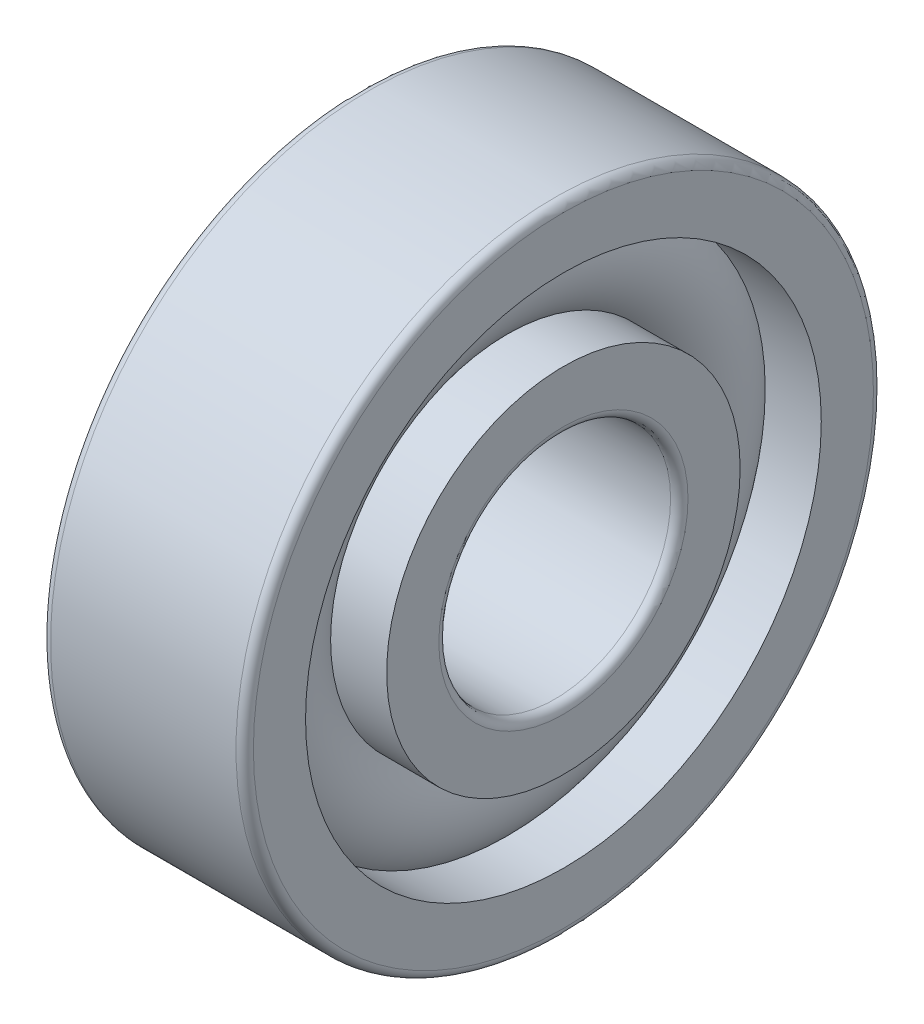
ISO-10303-21;
HEADER;
FILE_DESCRIPTION(('STEP AP214'),'2;1');
FILE_NAME('part.step','',(''),(''),'','','');
FILE_SCHEMA(('AUTOMOTIVE_DESIGN { 1 0 10303 214 1 1 1 1 }'));
ENDSEC;
DATA;
#1=APPLICATION_CONTEXT('core data for automotive mechanical design processes');
#2=APPLICATION_PROTOCOL_DEFINITION('international standard','automotive_design',2000,#1);
#3=PRODUCT_CONTEXT('',#1,'mechanical');
#4=PRODUCT('Part','Part','',(#3));
#5=PRODUCT_RELATED_PRODUCT_CATEGORY('part','',(#4));
#6=PRODUCT_DEFINITION_FORMATION('','',#4);
#7=PRODUCT_DEFINITION_CONTEXT('part definition',#1,'design');
#8=PRODUCT_DEFINITION('design','',#6,#7);
#9=PRODUCT_DEFINITION_SHAPE('','',#8);
#10=(LENGTH_UNIT() NAMED_UNIT(*) SI_UNIT(.MILLI.,.METRE.));
#11=(NAMED_UNIT(*) PLANE_ANGLE_UNIT() SI_UNIT($,.RADIAN.));
#12=(NAMED_UNIT(*) SI_UNIT($,.STERADIAN.) SOLID_ANGLE_UNIT());
#13=UNCERTAINTY_MEASURE_WITH_UNIT(LENGTH_MEASURE(1.E-05),#10,'distance_accuracy_value','');
#14=(GEOMETRIC_REPRESENTATION_CONTEXT(3) GLOBAL_UNCERTAINTY_ASSIGNED_CONTEXT((#13)) GLOBAL_UNIT_ASSIGNED_CONTEXT((#10,
#11,#12)) REPRESENTATION_CONTEXT('',''));
#15=CARTESIAN_POINT('',(0.,0.,0.));
#16=DIRECTION('',(0.,0.,1.));
#17=DIRECTION('',(1.,0.,0.));
#18=AXIS2_PLACEMENT_3D('',#15,#16,#17);
#19=CARTESIAN_POINT('',(0.,0.,0.));
#20=DIRECTION('',(-1.,0.,0.));
#21=DIRECTION('',(0.,0.,1.));
#22=AXIS2_PLACEMENT_3D('',#19,#20,#21);
#23=TOROIDAL_SURFACE('',#22,7.5,2.1);
#24=CARTESIAN_POINT('',(1.56524758424985,0.,0.));
#25=DIRECTION('',(-1.,0.,0.));
#26=DIRECTION('',(0.,0.,1.));
#27=AXIS2_PLACEMENT_3D('',#24,#25,#26);
#28=CIRCLE('',#27,8.90000000000001);
#29=CARTESIAN_POINT('',(1.56524758424985,0.,8.90000000000001));
#30=VERTEX_POINT('',#29);
#31=EDGE_CURVE('E34',#30,#30,#28,.F.);
#32=ORIENTED_EDGE('',*,*,#31,.T.);
#33=EDGE_LOOP('',(#32));
#34=FACE_BOUND('',#33,.T.);
#35=CARTESIAN_POINT('',(1.56524758424985,0.,0.));
#36=DIRECTION('',(-1.,0.,0.));
#37=DIRECTION('',(0.,0.,1.));
#38=AXIS2_PLACEMENT_3D('',#35,#36,#37);
#39=CIRCLE('',#38,6.1);
#40=CARTESIAN_POINT('',(1.56524758424985,0.,6.1));
#41=VERTEX_POINT('',#40);
#42=EDGE_CURVE('E10',#41,#41,#39,.T.);
#43=ORIENTED_EDGE('',*,*,#42,.T.);
#44=EDGE_LOOP('',(#43));
#45=FACE_BOUND('',#44,.T.);
#46=ADVANCED_FACE('F30',(#34,#45),#23,.T.);
#47=CARTESIAN_POINT('',(-20.6375,0.,0.));
#48=DIRECTION('',(1.,0.,0.));
#49=DIRECTION('',(0.,0.,-1.));
#50=AXIS2_PLACEMENT_3D('',#47,#48,#49);
#51=CYLINDRICAL_SURFACE('',#50,6.1);
#52=CARTESIAN_POINT('',(3.5,0.,0.));
#53=DIRECTION('',(1.,0.,0.));
#54=DIRECTION('',(0.,0.,-1.));
#55=AXIS2_PLACEMENT_3D('',#52,#53,#54);
#56=CIRCLE('',#55,6.1);
#57=CARTESIAN_POINT('',(3.5,0.,-6.1));
#58=VERTEX_POINT('',#57);
#59=EDGE_CURVE('E43',#58,#58,#56,.T.);
#60=ORIENTED_EDGE('',*,*,#59,.F.);
#61=EDGE_LOOP('',(#60));
#62=FACE_BOUND('',#61,.T.);
#63=ORIENTED_EDGE('',*,*,#42,.F.);
#64=EDGE_LOOP('',(#63));
#65=FACE_BOUND('',#64,.T.);
#66=ADVANCED_FACE('F82',(#62,#65),#51,.T.);
#67=CARTESIAN_POINT('',(-20.6375,0.,0.));
#68=DIRECTION('',(1.,0.,0.));
#69=DIRECTION('',(0.,0.,-1.));
#70=AXIS2_PLACEMENT_3D('',#67,#68,#69);
#71=CYLINDRICAL_SURFACE('',#70,6.1);
#72=CARTESIAN_POINT('',(-3.5,0.,0.));
#73=DIRECTION('',(1.,0.,0.));
#74=DIRECTION('',(0.,0.,-1.));
#75=AXIS2_PLACEMENT_3D('',#72,#73,#74);
#76=CIRCLE('',#75,6.1);
#77=CARTESIAN_POINT('',(-3.5,0.,-6.1));
#78=VERTEX_POINT('',#77);
#79=EDGE_CURVE('E52',#78,#78,#76,.T.);
#80=ORIENTED_EDGE('',*,*,#79,.T.);
#81=EDGE_LOOP('',(#80));
#82=FACE_BOUND('',#81,.T.);
#83=CARTESIAN_POINT('',(-1.56524758424985,0.,0.));
#84=DIRECTION('',(1.,0.,0.));
#85=DIRECTION('',(0.,0.,-1.));
#86=AXIS2_PLACEMENT_3D('',#83,#84,#85);
#87=CIRCLE('',#86,6.1);
#88=CARTESIAN_POINT('',(-1.56524758424985,0.,-6.1));
#89=VERTEX_POINT('',#88);
#90=EDGE_CURVE('E38',#89,#89,#87,.T.);
#91=ORIENTED_EDGE('',*,*,#90,.F.);
#92=EDGE_LOOP('',(#91));
#93=FACE_BOUND('',#92,.T.);
#94=ADVANCED_FACE('F85',(#82,#93),#71,.T.);
#95=CARTESIAN_POINT('',(3.5,4.3,0.));
#96=DIRECTION('',(1.,0.,0.));
#97=DIRECTION('',(0.,0.,-1.));
#98=AXIS2_PLACEMENT_3D('',#95,#96,#97);
#99=PLANE('',#98);
#100=ORIENTED_EDGE('',*,*,#59,.T.);
#101=EDGE_LOOP('',(#100));
#102=FACE_BOUND('',#101,.T.);
#103=CARTESIAN_POINT('',(3.5,0.,0.));
#104=DIRECTION('',(1.,0.,0.));
#105=DIRECTION('',(0.,0.,-1.));
#106=AXIS2_PLACEMENT_3D('',#103,#104,#105);
#107=CIRCLE('',#106,4.3);
#108=CARTESIAN_POINT('',(3.5,0.,-4.3));
#109=VERTEX_POINT('',#108);
#110=EDGE_CURVE('E74',#109,#109,#107,.T.);
#111=ORIENTED_EDGE('',*,*,#110,.F.);
#112=EDGE_LOOP('',(#111));
#113=FACE_BOUND('',#112,.T.);
#114=ADVANCED_FACE('F79',(#102,#113),#99,.T.);
#115=CARTESIAN_POINT('',(3.2,0.,0.));
#116=DIRECTION('',(1.,0.,0.));
#117=DIRECTION('',(0.,0.,-1.));
#118=AXIS2_PLACEMENT_3D('',#115,#116,#117);
#119=TOROIDAL_SURFACE('',#118,4.3,0.3);
#120=ORIENTED_EDGE('',*,*,#110,.T.);
#121=EDGE_LOOP('',(#120));
#122=FACE_BOUND('',#121,.T.);
#123=CARTESIAN_POINT('',(3.2,0.,0.));
#124=DIRECTION('',(1.,0.,0.));
#125=DIRECTION('',(0.,0.,-1.));
#126=AXIS2_PLACEMENT_3D('',#123,#124,#125);
#127=CIRCLE('',#126,4.);
#128=CARTESIAN_POINT('',(3.2,0.,-4.));
#129=VERTEX_POINT('',#128);
#130=EDGE_CURVE('E71',#129,#129,#127,.T.);
#131=ORIENTED_EDGE('',*,*,#130,.F.);
#132=EDGE_LOOP('',(#131));
#133=FACE_BOUND('',#132,.T.);
#134=ADVANCED_FACE('F96',(#122,#133),#119,.T.);
#135=CARTESIAN_POINT('',(-20.6375,0.,0.));
#136=DIRECTION('',(1.,0.,0.));
#137=DIRECTION('',(0.,0.,-1.));
#138=AXIS2_PLACEMENT_3D('',#135,#136,#137);
#139=CYLINDRICAL_SURFACE('',#138,4.);
#140=ORIENTED_EDGE('',*,*,#130,.T.);
#141=EDGE_LOOP('',(#140));
#142=FACE_BOUND('',#141,.T.);
#143=CARTESIAN_POINT('',(-3.2,0.,0.));
#144=DIRECTION('',(1.,0.,0.));
#145=DIRECTION('',(0.,0.,-1.));
#146=AXIS2_PLACEMENT_3D('',#143,#144,#145);
#147=CIRCLE('',#146,4.);
#148=CARTESIAN_POINT('',(-3.2,0.,-4.));
#149=VERTEX_POINT('',#148);
#150=EDGE_CURVE('E68',#149,#149,#147,.T.);
#151=ORIENTED_EDGE('',*,*,#150,.F.);
#152=EDGE_LOOP('',(#151));
#153=FACE_BOUND('',#152,.T.);
#154=ADVANCED_FACE('F99',(#142,#153),#139,.F.);
#155=CARTESIAN_POINT('',(-3.2,0.,0.));
#156=DIRECTION('',(1.,0.,0.));
#157=DIRECTION('',(0.,0.,-1.));
#158=AXIS2_PLACEMENT_3D('',#155,#156,#157);
#159=TOROIDAL_SURFACE('',#158,4.3,0.3);
#160=ORIENTED_EDGE('',*,*,#150,.T.);
#161=EDGE_LOOP('',(#160));
#162=FACE_BOUND('',#161,.T.);
#163=CARTESIAN_POINT('',(-3.5,0.,0.));
#164=DIRECTION('',(1.,0.,0.));
#165=DIRECTION('',(0.,0.,-1.));
#166=AXIS2_PLACEMENT_3D('',#163,#164,#165);
#167=CIRCLE('',#166,4.3);
#168=CARTESIAN_POINT('',(-3.5,0.,-4.3));
#169=VERTEX_POINT('',#168);
#170=EDGE_CURVE('E65',#169,#169,#167,.T.);
#171=ORIENTED_EDGE('',*,*,#170,.F.);
#172=EDGE_LOOP('',(#171));
#173=FACE_BOUND('',#172,.T.);
#174=ADVANCED_FACE('F103',(#162,#173),#159,.T.);
#175=CARTESIAN_POINT('',(-3.5,6.1,0.));
#176=DIRECTION('',(-1.,0.,0.));
#177=DIRECTION('',(0.,0.,1.));
#178=AXIS2_PLACEMENT_3D('',#175,#176,#177);
#179=PLANE('',#178);
#180=ORIENTED_EDGE('',*,*,#170,.T.);
#181=EDGE_LOOP('',(#180));
#182=FACE_BOUND('',#181,.T.);
#183=ORIENTED_EDGE('',*,*,#79,.F.);
#184=EDGE_LOOP('',(#183));
#185=FACE_BOUND('',#184,.T.);
#186=ADVANCED_FACE('F107',(#182,#185),#179,.T.);
#187=CARTESIAN_POINT('',(-1.56524758424985,0.,0.));
#188=DIRECTION('',(1.,0.,0.));
#189=DIRECTION('',(0.,0.,-1.));
#190=AXIS2_PLACEMENT_3D('',#187,#188,#189);
#191=CIRCLE('',#190,8.90000000000001);
#192=CARTESIAN_POINT('',(-1.56524758424985,0.,-8.90000000000001));
#193=VERTEX_POINT('',#192);
#194=EDGE_CURVE('E46',#193,#193,#191,.F.);
#195=ORIENTED_EDGE('',*,*,#194,.T.);
#196=EDGE_LOOP('',(#195));
#197=FACE_BOUND('',#196,.T.);
#198=ORIENTED_EDGE('',*,*,#90,.T.);
#199=EDGE_LOOP('',(#198));
#200=FACE_BOUND('',#199,.T.);
#201=ADVANCED_FACE('F32',(#197,#200),#23,.T.);
#202=CARTESIAN_POINT('',(-20.6375,0.,0.));
#203=DIRECTION('',(1.,0.,0.));
#204=DIRECTION('',(0.,0.,-1.));
#205=AXIS2_PLACEMENT_3D('',#202,#203,#204);
#206=CYLINDRICAL_SURFACE('',#205,8.90000000000001);
#207=CARTESIAN_POINT('',(3.5,0.,0.));
#208=DIRECTION('',(1.,0.,0.));
#209=DIRECTION('',(0.,0.,-1.));
#210=AXIS2_PLACEMENT_3D('',#207,#208,#209);
#211=CIRCLE('',#210,8.90000000000001);
#212=CARTESIAN_POINT('',(3.5,0.,-8.90000000000001));
#213=VERTEX_POINT('',#212);
#214=EDGE_CURVE('E48',#213,#213,#211,.T.);
#215=ORIENTED_EDGE('',*,*,#214,.T.);
#216=EDGE_LOOP('',(#215));
#217=FACE_BOUND('',#216,.T.);
#218=ORIENTED_EDGE('',*,*,#31,.F.);
#219=EDGE_LOOP('',(#218));
#220=FACE_BOUND('',#219,.T.);
#221=ADVANCED_FACE('F112',(#217,#220),#206,.F.);
#222=CARTESIAN_POINT('',(-20.6375,0.,0.));
#223=DIRECTION('',(1.,0.,0.));
#224=DIRECTION('',(0.,0.,-1.));
#225=AXIS2_PLACEMENT_3D('',#222,#223,#224);
#226=CYLINDRICAL_SURFACE('',#225,8.90000000000001);
#227=CARTESIAN_POINT('',(-3.5,0.,0.));
#228=DIRECTION('',(1.,0.,0.));
#229=DIRECTION('',(0.,0.,-1.));
#230=AXIS2_PLACEMENT_3D('',#227,#228,#229);
#231=CIRCLE('',#230,8.90000000000001);
#232=CARTESIAN_POINT('',(-3.5,0.,-8.90000000000001));
#233=VERTEX_POINT('',#232);
#234=EDGE_CURVE('E143',#233,#233,#231,.T.);
#235=ORIENTED_EDGE('',*,*,#234,.F.);
#236=EDGE_LOOP('',(#235));
#237=FACE_BOUND('',#236,.T.);
#238=ORIENTED_EDGE('',*,*,#194,.F.);
#239=EDGE_LOOP('',(#238));
#240=FACE_BOUND('',#239,.T.);
#241=ADVANCED_FACE('F115',(#237,#240),#226,.F.);
#242=CARTESIAN_POINT('',(3.5,10.7,0.));
#243=DIRECTION('',(1.,0.,0.));
#244=DIRECTION('',(0.,0.,-1.));
#245=AXIS2_PLACEMENT_3D('',#242,#243,#244);
#246=PLANE('',#245);
#247=CARTESIAN_POINT('',(3.5,0.,0.));
#248=DIRECTION('',(1.,0.,0.));
#249=DIRECTION('',(0.,0.,-1.));
#250=AXIS2_PLACEMENT_3D('',#247,#248,#249);
#251=CIRCLE('',#250,10.7);
#252=CARTESIAN_POINT('',(3.5,0.,-10.7));
#253=VERTEX_POINT('',#252);
#254=EDGE_CURVE('E54',#253,#253,#251,.T.);
#255=ORIENTED_EDGE('',*,*,#254,.T.);
#256=EDGE_LOOP('',(#255));
#257=FACE_BOUND('',#256,.T.);
#258=ORIENTED_EDGE('',*,*,#214,.F.);
#259=EDGE_LOOP('',(#258));
#260=FACE_BOUND('',#259,.T.);
#261=ADVANCED_FACE('F116',(#257,#260),#246,.T.);
#262=CARTESIAN_POINT('',(3.2,0.,0.));
#263=DIRECTION('',(1.,0.,0.));
#264=DIRECTION('',(0.,0.,-1.));
#265=AXIS2_PLACEMENT_3D('',#262,#263,#264);
#266=TOROIDAL_SURFACE('',#265,10.7,0.3);
#267=CARTESIAN_POINT('',(3.2,0.,0.));
#268=DIRECTION('',(1.,0.,0.));
#269=DIRECTION('',(0.,0.,-1.));
#270=AXIS2_PLACEMENT_3D('',#267,#268,#269);
#271=CIRCLE('',#270,11.);
#272=CARTESIAN_POINT('',(3.2,0.,-11.));
#273=VERTEX_POINT('',#272);
#274=EDGE_CURVE('E59',#273,#273,#271,.T.);
#275=ORIENTED_EDGE('',*,*,#274,.T.);
#276=EDGE_LOOP('',(#275));
#277=FACE_BOUND('',#276,.T.);
#278=ORIENTED_EDGE('',*,*,#254,.F.);
#279=EDGE_LOOP('',(#278));
#280=FACE_BOUND('',#279,.T.);
#281=ADVANCED_FACE('F119',(#277,#280),#266,.T.);
#282=CARTESIAN_POINT('',(-20.6375,0.,0.));
#283=DIRECTION('',(1.,0.,0.));
#284=DIRECTION('',(0.,0.,-1.));
#285=AXIS2_PLACEMENT_3D('',#282,#283,#284);
#286=CYLINDRICAL_SURFACE('',#285,11.);
#287=CARTESIAN_POINT('',(-3.2,0.,0.));
#288=DIRECTION('',(1.,0.,0.));
#289=DIRECTION('',(0.,0.,-1.));
#290=AXIS2_PLACEMENT_3D('',#287,#288,#289);
#291=CIRCLE('',#290,11.);
#292=CARTESIAN_POINT('',(-3.2,0.,-11.));
#293=VERTEX_POINT('',#292);
#294=EDGE_CURVE('E147',#293,#293,#291,.T.);
#295=ORIENTED_EDGE('',*,*,#294,.T.);
#296=EDGE_LOOP('',(#295));
#297=FACE_BOUND('',#296,.T.);
#298=ORIENTED_EDGE('',*,*,#274,.F.);
#299=EDGE_LOOP('',(#298));
#300=FACE_BOUND('',#299,.T.);
#301=ADVANCED_FACE('F123',(#297,#300),#286,.T.);
#302=CARTESIAN_POINT('',(-3.2,0.,0.));
#303=DIRECTION('',(1.,0.,0.));
#304=DIRECTION('',(0.,0.,-1.));
#305=AXIS2_PLACEMENT_3D('',#302,#303,#304);
#306=TOROIDAL_SURFACE('',#305,10.7,0.3);
#307=CARTESIAN_POINT('',(-3.5,0.,0.));
#308=DIRECTION('',(1.,0.,0.));
#309=DIRECTION('',(0.,0.,-1.));
#310=AXIS2_PLACEMENT_3D('',#307,#308,#309);
#311=CIRCLE('',#310,10.7);
#312=CARTESIAN_POINT('',(-3.5,0.,-10.7));
#313=VERTEX_POINT('',#312);
#314=EDGE_CURVE('E144',#313,#313,#311,.T.);
#315=ORIENTED_EDGE('',*,*,#314,.T.);
#316=EDGE_LOOP('',(#315));
#317=FACE_BOUND('',#316,.T.);
#318=ORIENTED_EDGE('',*,*,#294,.F.);
#319=EDGE_LOOP('',(#318));
#320=FACE_BOUND('',#319,.T.);
#321=ADVANCED_FACE('F127',(#317,#320),#306,.T.);
#322=CARTESIAN_POINT('',(-3.5,8.90000000000001,0.));
#323=DIRECTION('',(-1.,0.,0.));
#324=DIRECTION('',(0.,0.,1.));
#325=AXIS2_PLACEMENT_3D('',#322,#323,#324);
#326=PLANE('',#325);
#327=ORIENTED_EDGE('',*,*,#234,.T.);
#328=EDGE_LOOP('',(#327));
#329=FACE_BOUND('',#328,.T.);
#330=ORIENTED_EDGE('',*,*,#314,.F.);
#331=EDGE_LOOP('',(#330));
#332=FACE_BOUND('',#331,.T.);
#333=ADVANCED_FACE('F131',(#329,#332),#326,.T.);
#334=CLOSED_SHELL('',(#46,#66,#94,#114,#134,#154,#174,#186,#201,#221,#241,#261,#281,#301,#321,#333));
#335=MANIFOLD_SOLID_BREP('B2',#334);
#336=ADVANCED_BREP_SHAPE_REPRESENTATION('',(#18,#335),#14);
#337=SHAPE_DEFINITION_REPRESENTATION(#9,#336);
ENDSEC;
END-ISO-10303-21;
